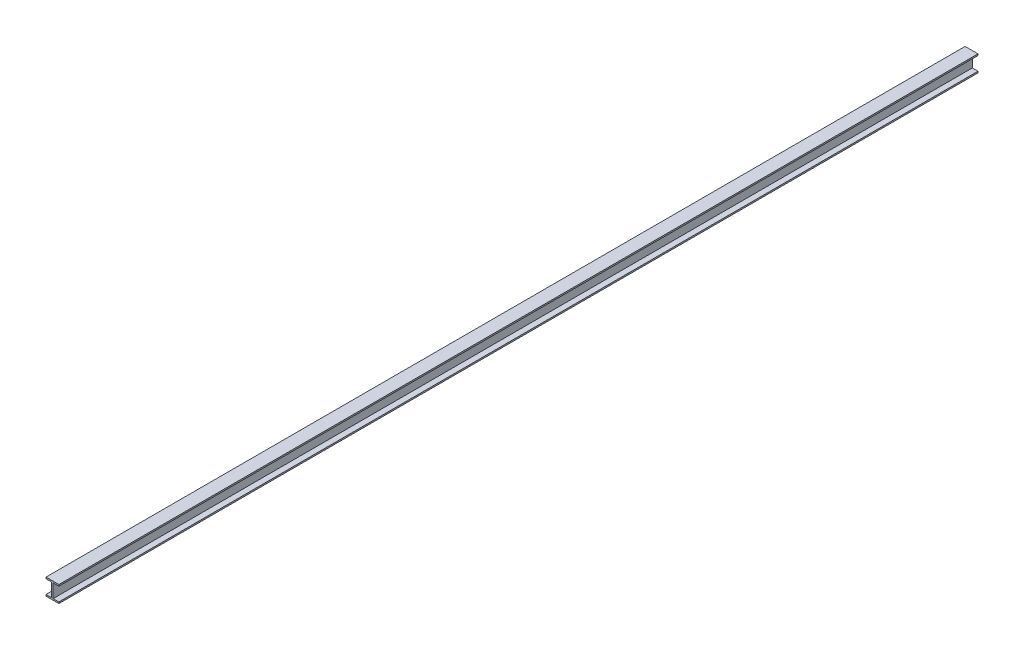
ISO-10303-21;
HEADER;
FILE_DESCRIPTION(('STEP AP214'),'2;1');
FILE_NAME('part.step','',(''),(''),'','','');
FILE_SCHEMA(('AUTOMOTIVE_DESIGN { 1 0 10303 214 1 1 1 1 }'));
ENDSEC;
DATA;
#1=APPLICATION_CONTEXT('core data for automotive mechanical design processes');
#2=APPLICATION_PROTOCOL_DEFINITION('international standard','automotive_design',2000,#1);
#3=PRODUCT_CONTEXT('',#1,'mechanical');
#4=PRODUCT('Part','Part','',(#3));
#5=PRODUCT_RELATED_PRODUCT_CATEGORY('part','',(#4));
#6=PRODUCT_DEFINITION_FORMATION('','',#4);
#7=PRODUCT_DEFINITION_CONTEXT('part definition',#1,'design');
#8=PRODUCT_DEFINITION('design','',#6,#7);
#9=PRODUCT_DEFINITION_SHAPE('','',#8);
#10=(LENGTH_UNIT() NAMED_UNIT(*) SI_UNIT(.MILLI.,.METRE.));
#11=(NAMED_UNIT(*) PLANE_ANGLE_UNIT() SI_UNIT($,.RADIAN.));
#12=(NAMED_UNIT(*) SI_UNIT($,.STERADIAN.) SOLID_ANGLE_UNIT());
#13=UNCERTAINTY_MEASURE_WITH_UNIT(LENGTH_MEASURE(1.E-05),#10,'distance_accuracy_value','');
#14=(GEOMETRIC_REPRESENTATION_CONTEXT(3) GLOBAL_UNCERTAINTY_ASSIGNED_CONTEXT((#13)) GLOBAL_UNIT_ASSIGNED_CONTEXT((#10,
#11,#12)) REPRESENTATION_CONTEXT('',''));
#15=CARTESIAN_POINT('',(0.,0.,0.));
#16=DIRECTION('',(0.,0.,1.));
#17=DIRECTION('',(1.,0.,0.));
#18=AXIS2_PLACEMENT_3D('',#15,#16,#17);
#19=CARTESIAN_POINT('',(0.,-328.,20000.));
#20=DIRECTION('',(0.,1.,0.));
#21=DIRECTION('',(0.,0.,1.));
#22=AXIS2_PLACEMENT_3D('',#19,#20,#21);
#23=PLANE('',#22);
#24=DIRECTION('',(1.,0.,0.));
#25=VECTOR('',#24,1.);
#26=CARTESIAN_POINT('',(0.,-328.,0.));
#27=LINE('',#26,#25);
#28=CARTESIAN_POINT('',(156.,-328.,0.));
#29=VERTEX_POINT('',#28);
#30=CARTESIAN_POINT('',(280.,-328.,0.));
#31=VERTEX_POINT('',#30);
#32=EDGE_CURVE('E164',#29,#31,#27,.T.);
#33=ORIENTED_EDGE('',*,*,#32,.F.);
#34=DIRECTION('',(0.,0.,-1.));
#35=VECTOR('',#34,1.);
#36=CARTESIAN_POINT('',(156.,-328.,20000.));
#37=LINE('',#36,#35);
#38=CARTESIAN_POINT('',(156.,-328.,20000.));
#39=VERTEX_POINT('',#38);
#40=EDGE_CURVE('E11',#39,#29,#37,.T.);
#41=ORIENTED_EDGE('',*,*,#40,.F.);
#42=DIRECTION('',(1.,0.,0.));
#43=VECTOR('',#42,1.);
#44=CARTESIAN_POINT('',(0.,-328.,20000.));
#45=LINE('',#44,#43);
#46=CARTESIAN_POINT('',(280.,-328.,20000.));
#47=VERTEX_POINT('',#46);
#48=EDGE_CURVE('E205',#39,#47,#45,.T.);
#49=ORIENTED_EDGE('',*,*,#48,.T.);
#50=DIRECTION('',(0.,0.,-1.));
#51=VECTOR('',#50,1.);
#52=CARTESIAN_POINT('',(280.,-328.,20000.));
#53=LINE('',#52,#51);
#54=EDGE_CURVE('E104',#47,#31,#53,.T.);
#55=ORIENTED_EDGE('',*,*,#54,.T.);
#56=EDGE_LOOP('',(#33,#41,#49,#55));
#57=FACE_BOUND('',#56,.T.);
#58=ADVANCED_FACE('F41',(#57),#23,.T.);
#59=CARTESIAN_POINT('',(156.,0.,20000.));
#60=DIRECTION('',(1.,0.,0.));
#61=DIRECTION('',(0.,1.,0.));
#62=AXIS2_PLACEMENT_3D('',#59,#60,#61);
#63=PLANE('',#62);
#64=DIRECTION('',(0.,-1.,0.));
#65=VECTOR('',#64,1.);
#66=CARTESIAN_POINT('',(156.,0.,0.));
#67=LINE('',#66,#65);
#68=CARTESIAN_POINT('',(156.,-32.,0.));
#69=VERTEX_POINT('',#68);
#70=EDGE_CURVE('E168',#69,#29,#67,.T.);
#71=ORIENTED_EDGE('',*,*,#70,.F.);
#72=DIRECTION('',(0.,0.,-1.));
#73=VECTOR('',#72,1.);
#74=CARTESIAN_POINT('',(156.,-32.,20000.));
#75=LINE('',#74,#73);
#76=CARTESIAN_POINT('',(156.,-32.,20000.));
#77=VERTEX_POINT('',#76);
#78=EDGE_CURVE('E50',#77,#69,#75,.T.);
#79=ORIENTED_EDGE('',*,*,#78,.F.);
#80=DIRECTION('',(0.,-1.,0.));
#81=VECTOR('',#80,1.);
#82=CARTESIAN_POINT('',(156.,0.,20000.));
#83=LINE('',#82,#81);
#84=EDGE_CURVE('E246',#77,#39,#83,.T.);
#85=ORIENTED_EDGE('',*,*,#84,.T.);
#86=ORIENTED_EDGE('',*,*,#40,.T.);
#87=EDGE_LOOP('',(#71,#79,#85,#86));
#88=FACE_BOUND('',#87,.T.);
#89=ADVANCED_FACE('F245',(#88),#63,.T.);
#90=CARTESIAN_POINT('',(0.,-32.,20000.));
#91=DIRECTION('',(0.,1.,0.));
#92=DIRECTION('',(-1.,0.,0.));
#93=AXIS2_PLACEMENT_3D('',#90,#91,#92);
#94=PLANE('',#93);
#95=DIRECTION('',(1.,0.,0.));
#96=VECTOR('',#95,1.);
#97=CARTESIAN_POINT('',(0.,-32.,0.));
#98=LINE('',#97,#96);
#99=CARTESIAN_POINT('',(280.,-32.,0.));
#100=VERTEX_POINT('',#99);
#101=EDGE_CURVE('E172',#69,#100,#98,.T.);
#102=ORIENTED_EDGE('',*,*,#101,.T.);
#103=DIRECTION('',(0.,0.,-1.));
#104=VECTOR('',#103,1.);
#105=CARTESIAN_POINT('',(280.,-32.,20000.));
#106=LINE('',#105,#104);
#107=CARTESIAN_POINT('',(280.,-32.,20000.));
#108=VERTEX_POINT('',#107);
#109=EDGE_CURVE('E229',#108,#100,#106,.T.);
#110=ORIENTED_EDGE('',*,*,#109,.F.);
#111=DIRECTION('',(1.,0.,0.));
#112=VECTOR('',#111,1.);
#113=CARTESIAN_POINT('',(0.,-32.,20000.));
#114=LINE('',#113,#112);
#115=EDGE_CURVE('E237',#77,#108,#114,.T.);
#116=ORIENTED_EDGE('',*,*,#115,.F.);
#117=ORIENTED_EDGE('',*,*,#78,.T.);
#118=EDGE_LOOP('',(#102,#110,#116,#117));
#119=FACE_BOUND('',#118,.T.);
#120=ADVANCED_FACE('F235',(#119),#94,.F.);
#121=CARTESIAN_POINT('',(280.,0.,20000.));
#122=DIRECTION('',(1.,0.,0.));
#123=DIRECTION('',(0.,0.,-1.));
#124=AXIS2_PLACEMENT_3D('',#121,#122,#123);
#125=PLANE('',#124);
#126=DIRECTION('',(0.,-1.,0.));
#127=VECTOR('',#126,1.);
#128=CARTESIAN_POINT('',(280.,0.,0.));
#129=LINE('',#128,#127);
#130=CARTESIAN_POINT('',(280.,0.,0.));
#131=VERTEX_POINT('',#130);
#132=EDGE_CURVE('E176',#131,#100,#129,.T.);
#133=ORIENTED_EDGE('',*,*,#132,.F.);
#134=DIRECTION('',(0.,0.,-1.));
#135=VECTOR('',#134,1.);
#136=CARTESIAN_POINT('',(280.,0.,20000.));
#137=LINE('',#136,#135);
#138=CARTESIAN_POINT('',(280.,0.,20000.));
#139=VERTEX_POINT('',#138);
#140=EDGE_CURVE('E226',#139,#131,#137,.T.);
#141=ORIENTED_EDGE('',*,*,#140,.F.);
#142=DIRECTION('',(0.,-1.,0.));
#143=VECTOR('',#142,1.);
#144=CARTESIAN_POINT('',(280.,0.,20000.));
#145=LINE('',#144,#143);
#146=EDGE_CURVE('E257',#139,#108,#145,.T.);
#147=ORIENTED_EDGE('',*,*,#146,.T.);
#148=ORIENTED_EDGE('',*,*,#109,.T.);
#149=EDGE_LOOP('',(#133,#141,#147,#148));
#150=FACE_BOUND('',#149,.T.);
#151=ADVANCED_FACE('F295',(#150),#125,.T.);
#152=CARTESIAN_POINT('',(0.,0.,20000.));
#153=DIRECTION('',(0.,1.,0.));
#154=DIRECTION('',(0.,0.,1.));
#155=AXIS2_PLACEMENT_3D('',#152,#153,#154);
#156=PLANE('',#155);
#157=DIRECTION('',(1.,0.,0.));
#158=VECTOR('',#157,1.);
#159=CARTESIAN_POINT('',(0.,0.,0.));
#160=LINE('',#159,#158);
#161=CARTESIAN_POINT('',(0.,0.,0.));
#162=VERTEX_POINT('',#161);
#163=EDGE_CURVE('E180',#162,#131,#160,.T.);
#164=ORIENTED_EDGE('',*,*,#163,.F.);
#165=DIRECTION('',(0.,0.,-1.));
#166=VECTOR('',#165,1.);
#167=CARTESIAN_POINT('',(0.,0.,20000.));
#168=LINE('',#167,#166);
#169=CARTESIAN_POINT('',(0.,0.,20000.));
#170=VERTEX_POINT('',#169);
#171=EDGE_CURVE('E223',#170,#162,#168,.T.);
#172=ORIENTED_EDGE('',*,*,#171,.F.);
#173=DIRECTION('',(1.,0.,0.));
#174=VECTOR('',#173,1.);
#175=CARTESIAN_POINT('',(0.,0.,20000.));
#176=LINE('',#175,#174);
#177=EDGE_CURVE('E261',#170,#139,#176,.T.);
#178=ORIENTED_EDGE('',*,*,#177,.T.);
#179=ORIENTED_EDGE('',*,*,#140,.T.);
#180=EDGE_LOOP('',(#164,#172,#178,#179));
#181=FACE_BOUND('',#180,.T.);
#182=ADVANCED_FACE('F292',(#181),#156,.T.);
#183=CARTESIAN_POINT('',(0.,0.,20000.));
#184=DIRECTION('',(1.,0.,0.));
#185=DIRECTION('',(0.,1.,0.));
#186=AXIS2_PLACEMENT_3D('',#183,#184,#185);
#187=PLANE('',#186);
#188=DIRECTION('',(0.,-1.,0.));
#189=VECTOR('',#188,1.);
#190=CARTESIAN_POINT('',(0.,0.,0.));
#191=LINE('',#190,#189);
#192=CARTESIAN_POINT('',(0.,-32.,0.));
#193=VERTEX_POINT('',#192);
#194=EDGE_CURVE('E184',#162,#193,#191,.T.);
#195=ORIENTED_EDGE('',*,*,#194,.T.);
#196=DIRECTION('',(0.,0.,-1.));
#197=VECTOR('',#196,1.);
#198=CARTESIAN_POINT('',(0.,-32.,20000.));
#199=LINE('',#198,#197);
#200=CARTESIAN_POINT('',(0.,-32.,20000.));
#201=VERTEX_POINT('',#200);
#202=EDGE_CURVE('E219',#201,#193,#199,.T.);
#203=ORIENTED_EDGE('',*,*,#202,.F.);
#204=DIRECTION('',(0.,-1.,0.));
#205=VECTOR('',#204,1.);
#206=CARTESIAN_POINT('',(0.,0.,20000.));
#207=LINE('',#206,#205);
#208=EDGE_CURVE('E265',#170,#201,#207,.T.);
#209=ORIENTED_EDGE('',*,*,#208,.F.);
#210=ORIENTED_EDGE('',*,*,#171,.T.);
#211=EDGE_LOOP('',(#195,#203,#209,#210));
#212=FACE_BOUND('',#211,.T.);
#213=ADVANCED_FACE('F289',(#212),#187,.F.);
#214=CARTESIAN_POINT('',(0.,-32.,20000.));
#215=DIRECTION('',(0.,1.,0.));
#216=DIRECTION('',(-1.,0.,0.));
#217=AXIS2_PLACEMENT_3D('',#214,#215,#216);
#218=PLANE('',#217);
#219=DIRECTION('',(1.,0.,0.));
#220=VECTOR('',#219,1.);
#221=CARTESIAN_POINT('',(0.,-32.,0.));
#222=LINE('',#221,#220);
#223=CARTESIAN_POINT('',(124.,-32.,0.));
#224=VERTEX_POINT('',#223);
#225=EDGE_CURVE('E187',#193,#224,#222,.T.);
#226=ORIENTED_EDGE('',*,*,#225,.T.);
#227=DIRECTION('',(0.,0.,-1.));
#228=VECTOR('',#227,1.);
#229=CARTESIAN_POINT('',(124.,-32.,20000.));
#230=LINE('',#229,#228);
#231=CARTESIAN_POINT('',(124.,-32.,20000.));
#232=VERTEX_POINT('',#231);
#233=EDGE_CURVE('E215',#232,#224,#230,.T.);
#234=ORIENTED_EDGE('',*,*,#233,.F.);
#235=DIRECTION('',(1.,0.,0.));
#236=VECTOR('',#235,1.);
#237=CARTESIAN_POINT('',(0.,-32.,20000.));
#238=LINE('',#237,#236);
#239=EDGE_CURVE('E268',#201,#232,#238,.T.);
#240=ORIENTED_EDGE('',*,*,#239,.F.);
#241=ORIENTED_EDGE('',*,*,#202,.T.);
#242=EDGE_LOOP('',(#226,#234,#240,#241));
#243=FACE_BOUND('',#242,.T.);
#244=ADVANCED_FACE('F285',(#243),#218,.F.);
#245=CARTESIAN_POINT('',(124.,0.,20000.));
#246=DIRECTION('',(1.,0.,0.));
#247=DIRECTION('',(0.,1.,0.));
#248=AXIS2_PLACEMENT_3D('',#245,#246,#247);
#249=PLANE('',#248);
#250=DIRECTION('',(0.,-1.,0.));
#251=VECTOR('',#250,1.);
#252=CARTESIAN_POINT('',(124.,0.,0.));
#253=LINE('',#252,#251);
#254=CARTESIAN_POINT('',(124.,-328.,0.));
#255=VERTEX_POINT('',#254);
#256=EDGE_CURVE('E190',#224,#255,#253,.T.);
#257=ORIENTED_EDGE('',*,*,#256,.T.);
#258=DIRECTION('',(0.,0.,-1.));
#259=VECTOR('',#258,1.);
#260=CARTESIAN_POINT('',(124.,-328.,20000.));
#261=LINE('',#260,#259);
#262=CARTESIAN_POINT('',(124.,-328.,20000.));
#263=VERTEX_POINT('',#262);
#264=EDGE_CURVE('E212',#263,#255,#261,.T.);
#265=ORIENTED_EDGE('',*,*,#264,.F.);
#266=DIRECTION('',(0.,-1.,0.));
#267=VECTOR('',#266,1.);
#268=CARTESIAN_POINT('',(124.,0.,20000.));
#269=LINE('',#268,#267);
#270=EDGE_CURVE('E158',#232,#263,#269,.T.);
#271=ORIENTED_EDGE('',*,*,#270,.F.);
#272=ORIENTED_EDGE('',*,*,#233,.T.);
#273=EDGE_LOOP('',(#257,#265,#271,#272));
#274=FACE_BOUND('',#273,.T.);
#275=ADVANCED_FACE('F276',(#274),#249,.F.);
#276=CARTESIAN_POINT('',(0.,-328.,20000.));
#277=DIRECTION('',(0.,1.,0.));
#278=DIRECTION('',(0.,0.,1.));
#279=AXIS2_PLACEMENT_3D('',#276,#277,#278);
#280=PLANE('',#279);
#281=DIRECTION('',(1.,0.,0.));
#282=VECTOR('',#281,1.);
#283=CARTESIAN_POINT('',(0.,-328.,0.));
#284=LINE('',#283,#282);
#285=CARTESIAN_POINT('',(0.,-328.,0.));
#286=VERTEX_POINT('',#285);
#287=EDGE_CURVE('E194',#286,#255,#284,.T.);
#288=ORIENTED_EDGE('',*,*,#287,.F.);
#289=DIRECTION('',(0.,0.,-1.));
#290=VECTOR('',#289,1.);
#291=CARTESIAN_POINT('',(0.,-328.,20000.));
#292=LINE('',#291,#290);
#293=CARTESIAN_POINT('',(0.,-328.,20000.));
#294=VERTEX_POINT('',#293);
#295=EDGE_CURVE('E144',#294,#286,#292,.T.);
#296=ORIENTED_EDGE('',*,*,#295,.F.);
#297=DIRECTION('',(1.,0.,0.));
#298=VECTOR('',#297,1.);
#299=CARTESIAN_POINT('',(0.,-328.,20000.));
#300=LINE('',#299,#298);
#301=EDGE_CURVE('E154',#294,#263,#300,.T.);
#302=ORIENTED_EDGE('',*,*,#301,.T.);
#303=ORIENTED_EDGE('',*,*,#264,.T.);
#304=EDGE_LOOP('',(#288,#296,#302,#303));
#305=FACE_BOUND('',#304,.T.);
#306=ADVANCED_FACE('F280',(#305),#280,.T.);
#307=CARTESIAN_POINT('',(0.,0.,20000.));
#308=DIRECTION('',(-1.,0.,0.));
#309=DIRECTION('',(0.,0.,1.));
#310=AXIS2_PLACEMENT_3D('',#307,#308,#309);
#311=PLANE('',#310);
#312=DIRECTION('',(0.,1.,0.));
#313=VECTOR('',#312,1.);
#314=CARTESIAN_POINT('',(0.,0.,0.));
#315=LINE('',#314,#313);
#316=CARTESIAN_POINT('',(0.,-360.,0.));
#317=VERTEX_POINT('',#316);
#318=EDGE_CURVE('E142',#317,#286,#315,.T.);
#319=ORIENTED_EDGE('',*,*,#318,.F.);
#320=DIRECTION('',(0.,0.,-1.));
#321=VECTOR('',#320,1.);
#322=CARTESIAN_POINT('',(0.,-360.,20000.));
#323=LINE('',#322,#321);
#324=CARTESIAN_POINT('',(0.,-360.,20000.));
#325=VERTEX_POINT('',#324);
#326=EDGE_CURVE('E136',#325,#317,#323,.T.);
#327=ORIENTED_EDGE('',*,*,#326,.F.);
#328=DIRECTION('',(0.,1.,0.));
#329=VECTOR('',#328,1.);
#330=CARTESIAN_POINT('',(0.,0.,20000.));
#331=LINE('',#330,#329);
#332=EDGE_CURVE('E140',#325,#294,#331,.T.);
#333=ORIENTED_EDGE('',*,*,#332,.T.);
#334=ORIENTED_EDGE('',*,*,#295,.T.);
#335=EDGE_LOOP('',(#319,#327,#333,#334));
#336=FACE_BOUND('',#335,.T.);
#337=ADVANCED_FACE('F138',(#336),#311,.T.);
#338=CARTESIAN_POINT('',(0.,-360.,20000.));
#339=DIRECTION('',(0.,1.,0.));
#340=DIRECTION('',(0.,0.,1.));
#341=AXIS2_PLACEMENT_3D('',#338,#339,#340);
#342=PLANE('',#341);
#343=DIRECTION('',(1.,0.,0.));
#344=VECTOR('',#343,1.);
#345=CARTESIAN_POINT('',(0.,-360.,0.));
#346=LINE('',#345,#344);
#347=CARTESIAN_POINT('',(280.,-360.,0.));
#348=VERTEX_POINT('',#347);
#349=EDGE_CURVE('E97',#317,#348,#346,.T.);
#350=ORIENTED_EDGE('',*,*,#349,.T.);
#351=DIRECTION('',(0.,0.,-1.));
#352=VECTOR('',#351,1.);
#353=CARTESIAN_POINT('',(280.,-360.,20000.));
#354=LINE('',#353,#352);
#355=CARTESIAN_POINT('',(280.,-360.,20000.));
#356=VERTEX_POINT('',#355);
#357=EDGE_CURVE('E145',#356,#348,#354,.T.);
#358=ORIENTED_EDGE('',*,*,#357,.F.);
#359=DIRECTION('',(1.,0.,0.));
#360=VECTOR('',#359,1.);
#361=CARTESIAN_POINT('',(0.,-360.,20000.));
#362=LINE('',#361,#360);
#363=EDGE_CURVE('E147',#325,#356,#362,.T.);
#364=ORIENTED_EDGE('',*,*,#363,.F.);
#365=ORIENTED_EDGE('',*,*,#326,.T.);
#366=EDGE_LOOP('',(#350,#358,#364,#365));
#367=FACE_BOUND('',#366,.T.);
#368=ADVANCED_FACE('F148',(#367),#342,.F.);
#369=CARTESIAN_POINT('',(280.,0.,20000.));
#370=DIRECTION('',(-1.,0.,0.));
#371=DIRECTION('',(0.,0.,1.));
#372=AXIS2_PLACEMENT_3D('',#369,#370,#371);
#373=PLANE('',#372);
#374=DIRECTION('',(0.,1.,0.));
#375=VECTOR('',#374,1.);
#376=CARTESIAN_POINT('',(280.,0.,0.));
#377=LINE('',#376,#375);
#378=EDGE_CURVE('E202',#348,#31,#377,.T.);
#379=ORIENTED_EDGE('',*,*,#378,.T.);
#380=ORIENTED_EDGE('',*,*,#54,.F.);
#381=DIRECTION('',(0.,1.,0.));
#382=VECTOR('',#381,1.);
#383=CARTESIAN_POINT('',(280.,0.,20000.));
#384=LINE('',#383,#382);
#385=EDGE_CURVE('E58',#356,#47,#384,.T.);
#386=ORIENTED_EDGE('',*,*,#385,.F.);
#387=ORIENTED_EDGE('',*,*,#357,.T.);
#388=EDGE_LOOP('',(#379,#380,#386,#387));
#389=FACE_BOUND('',#388,.T.);
#390=ADVANCED_FACE('F249',(#389),#373,.F.);
#391=CARTESIAN_POINT('',(0.,0.,20000.));
#392=DIRECTION('',(0.,0.,1.));
#393=DIRECTION('',(1.,0.,0.));
#394=AXIS2_PLACEMENT_3D('',#391,#392,#393);
#395=PLANE('',#394);
#396=ORIENTED_EDGE('',*,*,#48,.F.);
#397=ORIENTED_EDGE('',*,*,#84,.F.);
#398=ORIENTED_EDGE('',*,*,#115,.T.);
#399=ORIENTED_EDGE('',*,*,#146,.F.);
#400=ORIENTED_EDGE('',*,*,#177,.F.);
#401=ORIENTED_EDGE('',*,*,#208,.T.);
#402=ORIENTED_EDGE('',*,*,#239,.T.);
#403=ORIENTED_EDGE('',*,*,#270,.T.);
#404=ORIENTED_EDGE('',*,*,#301,.F.);
#405=ORIENTED_EDGE('',*,*,#332,.F.);
#406=ORIENTED_EDGE('',*,*,#363,.T.);
#407=ORIENTED_EDGE('',*,*,#385,.T.);
#408=EDGE_LOOP('',(#396,#397,#398,#399,#400,#401,#402,#403,#404,#405,#406,#407));
#409=FACE_BOUND('',#408,.T.);
#410=ADVANCED_FACE('F152',(#409),#395,.T.);
#411=CARTESIAN_POINT('',(0.,0.,0.));
#412=DIRECTION('',(0.,0.,1.));
#413=DIRECTION('',(1.,0.,0.));
#414=AXIS2_PLACEMENT_3D('',#411,#412,#413);
#415=PLANE('',#414);
#416=ORIENTED_EDGE('',*,*,#32,.T.);
#417=ORIENTED_EDGE('',*,*,#378,.F.);
#418=ORIENTED_EDGE('',*,*,#349,.F.);
#419=ORIENTED_EDGE('',*,*,#318,.T.);
#420=ORIENTED_EDGE('',*,*,#287,.T.);
#421=ORIENTED_EDGE('',*,*,#256,.F.);
#422=ORIENTED_EDGE('',*,*,#225,.F.);
#423=ORIENTED_EDGE('',*,*,#194,.F.);
#424=ORIENTED_EDGE('',*,*,#163,.T.);
#425=ORIENTED_EDGE('',*,*,#132,.T.);
#426=ORIENTED_EDGE('',*,*,#101,.F.);
#427=ORIENTED_EDGE('',*,*,#70,.T.);
#428=EDGE_LOOP('',(#416,#417,#418,#419,#420,#421,#422,#423,#424,#425,#426,#427));
#429=FACE_BOUND('',#428,.T.);
#430=ADVANCED_FACE('F243',(#429),#415,.F.);
#431=CLOSED_SHELL('',(#58,#89,#120,#151,#182,#213,#244,#275,#306,#337,#368,#390,#410,#430));
#432=MANIFOLD_SOLID_BREP('B2',#431);
#433=ADVANCED_BREP_SHAPE_REPRESENTATION('',(#18,#432),#14);
#434=SHAPE_DEFINITION_REPRESENTATION(#9,#433);
ENDSEC;
END-ISO-10303-21;
